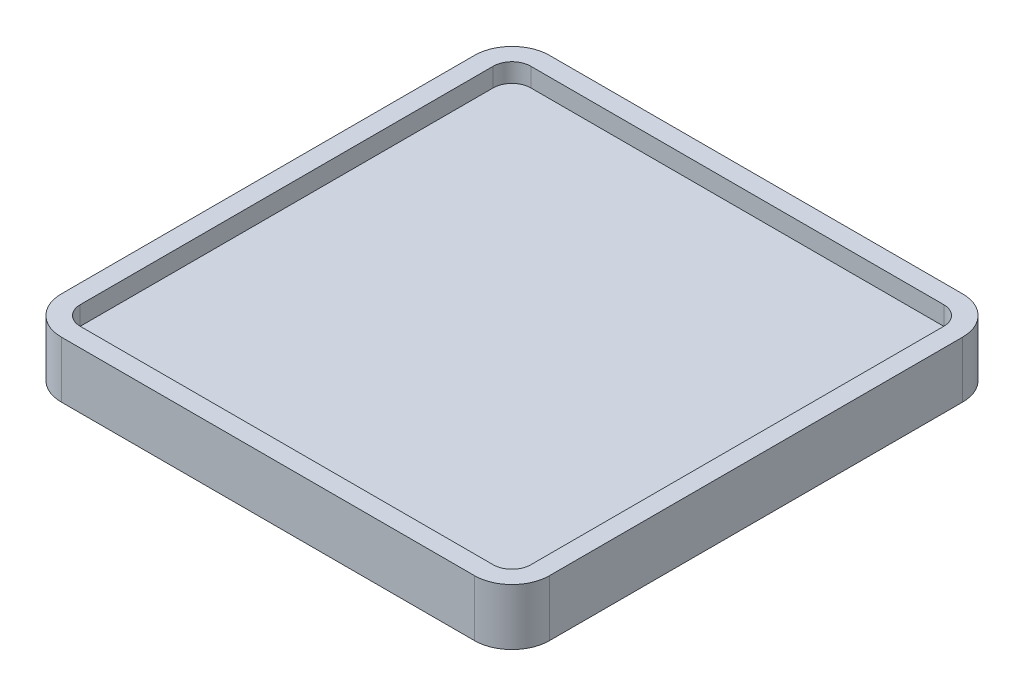
ISO-10303-21;
HEADER;
FILE_DESCRIPTION(('STEP AP214'),'2;1');
FILE_NAME('part.step','',(''),(''),'','','');
FILE_SCHEMA(('AUTOMOTIVE_DESIGN { 1 0 10303 214 1 1 1 1 }'));
ENDSEC;
DATA;
#1=APPLICATION_CONTEXT('core data for automotive mechanical design processes');
#2=APPLICATION_PROTOCOL_DEFINITION('international standard','automotive_design',2000,#1);
#3=PRODUCT_CONTEXT('',#1,'mechanical');
#4=PRODUCT('Part','Part','',(#3));
#5=PRODUCT_RELATED_PRODUCT_CATEGORY('part','',(#4));
#6=PRODUCT_DEFINITION_FORMATION('','',#4);
#7=PRODUCT_DEFINITION_CONTEXT('part definition',#1,'design');
#8=PRODUCT_DEFINITION('design','',#6,#7);
#9=PRODUCT_DEFINITION_SHAPE('','',#8);
#10=(LENGTH_UNIT() NAMED_UNIT(*) SI_UNIT(.MILLI.,.METRE.));
#11=(NAMED_UNIT(*) PLANE_ANGLE_UNIT() SI_UNIT($,.RADIAN.));
#12=(NAMED_UNIT(*) SI_UNIT($,.STERADIAN.) SOLID_ANGLE_UNIT());
#13=UNCERTAINTY_MEASURE_WITH_UNIT(LENGTH_MEASURE(1.E-05),#10,'distance_accuracy_value','');
#14=(GEOMETRIC_REPRESENTATION_CONTEXT(3) GLOBAL_UNCERTAINTY_ASSIGNED_CONTEXT((#13)) GLOBAL_UNIT_ASSIGNED_CONTEXT((#10,
#11,#12)) REPRESENTATION_CONTEXT('',''));
#15=CARTESIAN_POINT('',(0.,0.,0.));
#16=DIRECTION('',(0.,0.,1.));
#17=DIRECTION('',(1.,0.,0.));
#18=AXIS2_PLACEMENT_3D('',#15,#16,#17);
#19=CARTESIAN_POINT('',(-11.,1.,-11.));
#20=DIRECTION('',(0.,1.,0.));
#21=DIRECTION('',(0.,0.,1.));
#22=AXIS2_PLACEMENT_3D('',#19,#20,#21);
#23=PLANE('',#22);
#24=CARTESIAN_POINT('',(-11.,1.,-11.));
#25=DIRECTION('',(0.,1.,0.));
#26=DIRECTION('',(0.,0.,1.));
#27=AXIS2_PLACEMENT_3D('',#24,#25,#26);
#28=CIRCLE('',#27,2.);
#29=CARTESIAN_POINT('',(-11.,1.,-13.));
#30=VERTEX_POINT('',#29);
#31=CARTESIAN_POINT('',(-13.,1.,-11.));
#32=VERTEX_POINT('',#31);
#33=EDGE_CURVE('E156',#30,#32,#28,.T.);
#34=ORIENTED_EDGE('',*,*,#33,.T.);
#35=DIRECTION('',(0.,0.,1.));
#36=VECTOR('',#35,1.);
#37=CARTESIAN_POINT('',(-13.,1.,-11.));
#38=LINE('',#37,#36);
#39=CARTESIAN_POINT('',(-13.,1.,11.));
#40=VERTEX_POINT('',#39);
#41=EDGE_CURVE('E246',#32,#40,#38,.T.);
#42=ORIENTED_EDGE('',*,*,#41,.T.);
#43=CARTESIAN_POINT('',(-11.,1.,11.));
#44=DIRECTION('',(0.,1.,0.));
#45=DIRECTION('',(0.,0.,1.));
#46=AXIS2_PLACEMENT_3D('',#43,#44,#45);
#47=CIRCLE('',#46,2.);
#48=CARTESIAN_POINT('',(-11.,1.,13.));
#49=VERTEX_POINT('',#48);
#50=EDGE_CURVE('E248',#40,#49,#47,.T.);
#51=ORIENTED_EDGE('',*,*,#50,.T.);
#52=DIRECTION('',(1.,0.,0.));
#53=VECTOR('',#52,1.);
#54=CARTESIAN_POINT('',(-11.,1.,13.));
#55=LINE('',#54,#53);
#56=CARTESIAN_POINT('',(11.,1.,13.));
#57=VERTEX_POINT('',#56);
#58=EDGE_CURVE('E250',#49,#57,#55,.T.);
#59=ORIENTED_EDGE('',*,*,#58,.T.);
#60=CARTESIAN_POINT('',(11.,1.,11.));
#61=DIRECTION('',(0.,1.,0.));
#62=DIRECTION('',(0.,0.,1.));
#63=AXIS2_PLACEMENT_3D('',#60,#61,#62);
#64=CIRCLE('',#63,2.);
#65=CARTESIAN_POINT('',(13.,1.,11.));
#66=VERTEX_POINT('',#65);
#67=EDGE_CURVE('E252',#57,#66,#64,.T.);
#68=ORIENTED_EDGE('',*,*,#67,.T.);
#69=DIRECTION('',(0.,0.,-1.));
#70=VECTOR('',#69,1.);
#71=CARTESIAN_POINT('',(13.,1.,-11.));
#72=LINE('',#71,#70);
#73=CARTESIAN_POINT('',(13.,1.,-11.));
#74=VERTEX_POINT('',#73);
#75=EDGE_CURVE('E254',#66,#74,#72,.T.);
#76=ORIENTED_EDGE('',*,*,#75,.T.);
#77=CARTESIAN_POINT('',(11.,1.,-11.));
#78=DIRECTION('',(0.,1.,0.));
#79=DIRECTION('',(0.,0.,1.));
#80=AXIS2_PLACEMENT_3D('',#77,#78,#79);
#81=CIRCLE('',#80,2.);
#82=CARTESIAN_POINT('',(11.,1.,-13.));
#83=VERTEX_POINT('',#82);
#84=EDGE_CURVE('E256',#74,#83,#81,.T.);
#85=ORIENTED_EDGE('',*,*,#84,.T.);
#86=DIRECTION('',(-1.,0.,0.));
#87=VECTOR('',#86,1.);
#88=CARTESIAN_POINT('',(-11.,1.,-13.));
#89=LINE('',#88,#87);
#90=EDGE_CURVE('E61',#83,#30,#89,.T.);
#91=ORIENTED_EDGE('',*,*,#90,.T.);
#92=EDGE_LOOP('',(#34,#42,#51,#59,#68,#76,#85,#91));
#93=FACE_BOUND('',#92,.T.);
#94=DIRECTION('',(1.,0.,0.));
#95=VECTOR('',#94,1.);
#96=CARTESIAN_POINT('',(-11.,1.,12.));
#97=LINE('',#96,#95);
#98=CARTESIAN_POINT('',(-11.,1.,12.));
#99=VERTEX_POINT('',#98);
#100=CARTESIAN_POINT('',(11.,1.,12.));
#101=VERTEX_POINT('',#100);
#102=EDGE_CURVE('E192',#99,#101,#97,.T.);
#103=ORIENTED_EDGE('',*,*,#102,.F.);
#104=CARTESIAN_POINT('',(-11.,1.,11.));
#105=DIRECTION('',(0.,1.,0.));
#106=DIRECTION('',(0.,0.,1.));
#107=AXIS2_PLACEMENT_3D('',#104,#105,#106);
#108=CIRCLE('',#107,1.);
#109=CARTESIAN_POINT('',(-12.,1.,11.));
#110=VERTEX_POINT('',#109);
#111=EDGE_CURVE('E190',#110,#99,#108,.T.);
#112=ORIENTED_EDGE('',*,*,#111,.F.);
#113=DIRECTION('',(0.,0.,1.));
#114=VECTOR('',#113,1.);
#115=CARTESIAN_POINT('',(-12.,1.,-11.));
#116=LINE('',#115,#114);
#117=CARTESIAN_POINT('',(-12.,1.,-11.));
#118=VERTEX_POINT('',#117);
#119=EDGE_CURVE('E205',#118,#110,#116,.T.);
#120=ORIENTED_EDGE('',*,*,#119,.F.);
#121=CARTESIAN_POINT('',(-11.,1.,-11.));
#122=DIRECTION('',(0.,1.,0.));
#123=DIRECTION('',(0.,0.,1.));
#124=AXIS2_PLACEMENT_3D('',#121,#122,#123);
#125=CIRCLE('',#124,1.);
#126=CARTESIAN_POINT('',(-11.,1.,-12.));
#127=VERTEX_POINT('',#126);
#128=EDGE_CURVE('E203',#127,#118,#125,.T.);
#129=ORIENTED_EDGE('',*,*,#128,.F.);
#130=DIRECTION('',(-1.,0.,0.));
#131=VECTOR('',#130,1.);
#132=CARTESIAN_POINT('',(-11.,1.,-12.));
#133=LINE('',#132,#131);
#134=CARTESIAN_POINT('',(11.,1.,-12.));
#135=VERTEX_POINT('',#134);
#136=EDGE_CURVE('E201',#135,#127,#133,.T.);
#137=ORIENTED_EDGE('',*,*,#136,.F.);
#138=CARTESIAN_POINT('',(11.,1.,-11.));
#139=DIRECTION('',(0.,1.,0.));
#140=DIRECTION('',(0.,0.,1.));
#141=AXIS2_PLACEMENT_3D('',#138,#139,#140);
#142=CIRCLE('',#141,1.);
#143=CARTESIAN_POINT('',(12.,1.,-11.));
#144=VERTEX_POINT('',#143);
#145=EDGE_CURVE('E199',#144,#135,#142,.T.);
#146=ORIENTED_EDGE('',*,*,#145,.F.);
#147=DIRECTION('',(0.,0.,-1.));
#148=VECTOR('',#147,1.);
#149=CARTESIAN_POINT('',(12.,1.,-11.));
#150=LINE('',#149,#148);
#151=CARTESIAN_POINT('',(12.,1.,11.));
#152=VERTEX_POINT('',#151);
#153=EDGE_CURVE('E197',#152,#144,#150,.T.);
#154=ORIENTED_EDGE('',*,*,#153,.F.);
#155=CARTESIAN_POINT('',(11.,1.,11.));
#156=DIRECTION('',(0.,1.,0.));
#157=DIRECTION('',(0.,0.,1.));
#158=AXIS2_PLACEMENT_3D('',#155,#156,#157);
#159=CIRCLE('',#158,1.);
#160=EDGE_CURVE('E195',#101,#152,#159,.T.);
#161=ORIENTED_EDGE('',*,*,#160,.F.);
#162=EDGE_LOOP('',(#103,#112,#120,#129,#137,#146,#154,#161));
#163=FACE_BOUND('',#162,.T.);
#164=ADVANCED_FACE('F38',(#93,#163),#23,.T.);
#165=CARTESIAN_POINT('',(-11.,1.,-11.));
#166=DIRECTION('',(0.,-1.,0.));
#167=DIRECTION('',(0.,0.,-1.));
#168=AXIS2_PLACEMENT_3D('',#165,#166,#167);
#169=CYLINDRICAL_SURFACE('',#168,2.);
#170=DIRECTION('',(0.,-1.,0.));
#171=VECTOR('',#170,1.);
#172=CARTESIAN_POINT('',(-11.,1.,-13.));
#173=LINE('',#172,#171);
#174=CARTESIAN_POINT('',(-11.,-2.,-13.));
#175=VERTEX_POINT('',#174);
#176=EDGE_CURVE('E151',#30,#175,#173,.T.);
#177=ORIENTED_EDGE('',*,*,#176,.T.);
#178=CARTESIAN_POINT('',(-11.,-2.,-11.));
#179=DIRECTION('',(0.,-1.,0.));
#180=DIRECTION('',(0.,0.,-1.));
#181=AXIS2_PLACEMENT_3D('',#178,#179,#180);
#182=CIRCLE('',#181,2.);
#183=CARTESIAN_POINT('',(-13.,-2.,-11.));
#184=VERTEX_POINT('',#183);
#185=EDGE_CURVE('E155',#184,#175,#182,.T.);
#186=ORIENTED_EDGE('',*,*,#185,.F.);
#187=DIRECTION('',(0.,-1.,0.));
#188=VECTOR('',#187,1.);
#189=CARTESIAN_POINT('',(-13.,1.,-11.));
#190=LINE('',#189,#188);
#191=EDGE_CURVE('E11',#32,#184,#190,.T.);
#192=ORIENTED_EDGE('',*,*,#191,.F.);
#193=ORIENTED_EDGE('',*,*,#33,.F.);
#194=EDGE_LOOP('',(#177,#186,#192,#193));
#195=FACE_BOUND('',#194,.T.);
#196=ADVANCED_FACE('F40',(#195),#169,.T.);
#197=CARTESIAN_POINT('',(-13.,1.,-11.));
#198=DIRECTION('',(1.,0.,0.));
#199=DIRECTION('',(0.,0.,-1.));
#200=AXIS2_PLACEMENT_3D('',#197,#198,#199);
#201=PLANE('',#200);
#202=ORIENTED_EDGE('',*,*,#191,.T.);
#203=DIRECTION('',(0.,0.,-1.));
#204=VECTOR('',#203,1.);
#205=CARTESIAN_POINT('',(-13.,-2.,11.));
#206=LINE('',#205,#204);
#207=CARTESIAN_POINT('',(-13.,-2.,11.));
#208=VERTEX_POINT('',#207);
#209=EDGE_CURVE('E173',#208,#184,#206,.T.);
#210=ORIENTED_EDGE('',*,*,#209,.F.);
#211=DIRECTION('',(0.,-1.,0.));
#212=VECTOR('',#211,1.);
#213=CARTESIAN_POINT('',(-13.,1.,11.));
#214=LINE('',#213,#212);
#215=EDGE_CURVE('E46',#40,#208,#214,.T.);
#216=ORIENTED_EDGE('',*,*,#215,.F.);
#217=ORIENTED_EDGE('',*,*,#41,.F.);
#218=EDGE_LOOP('',(#202,#210,#216,#217));
#219=FACE_BOUND('',#218,.T.);
#220=ADVANCED_FACE('F275',(#219),#201,.F.);
#221=CARTESIAN_POINT('',(-11.,1.,11.));
#222=DIRECTION('',(0.,-1.,0.));
#223=DIRECTION('',(0.,0.,-1.));
#224=AXIS2_PLACEMENT_3D('',#221,#222,#223);
#225=CYLINDRICAL_SURFACE('',#224,2.);
#226=ORIENTED_EDGE('',*,*,#215,.T.);
#227=CARTESIAN_POINT('',(-11.,-2.,11.));
#228=DIRECTION('',(0.,-1.,0.));
#229=DIRECTION('',(0.,0.,-1.));
#230=AXIS2_PLACEMENT_3D('',#227,#228,#229);
#231=CIRCLE('',#230,2.);
#232=CARTESIAN_POINT('',(-11.,-2.,13.));
#233=VERTEX_POINT('',#232);
#234=EDGE_CURVE('E186',#233,#208,#231,.T.);
#235=ORIENTED_EDGE('',*,*,#234,.F.);
#236=DIRECTION('',(0.,-1.,0.));
#237=VECTOR('',#236,1.);
#238=CARTESIAN_POINT('',(-11.,1.,13.));
#239=LINE('',#238,#237);
#240=EDGE_CURVE('E266',#49,#233,#239,.T.);
#241=ORIENTED_EDGE('',*,*,#240,.F.);
#242=ORIENTED_EDGE('',*,*,#50,.F.);
#243=EDGE_LOOP('',(#226,#235,#241,#242));
#244=FACE_BOUND('',#243,.T.);
#245=ADVANCED_FACE('F271',(#244),#225,.T.);
#246=CARTESIAN_POINT('',(-11.,1.,13.));
#247=DIRECTION('',(0.,0.,-1.));
#248=DIRECTION('',(-1.,0.,0.));
#249=AXIS2_PLACEMENT_3D('',#246,#247,#248);
#250=PLANE('',#249);
#251=ORIENTED_EDGE('',*,*,#240,.T.);
#252=DIRECTION('',(-1.,0.,0.));
#253=VECTOR('',#252,1.);
#254=CARTESIAN_POINT('',(11.,-2.,13.));
#255=LINE('',#254,#253);
#256=CARTESIAN_POINT('',(11.,-2.,13.));
#257=VERTEX_POINT('',#256);
#258=EDGE_CURVE('E183',#257,#233,#255,.T.);
#259=ORIENTED_EDGE('',*,*,#258,.F.);
#260=DIRECTION('',(0.,-1.,0.));
#261=VECTOR('',#260,1.);
#262=CARTESIAN_POINT('',(11.,1.,13.));
#263=LINE('',#262,#261);
#264=EDGE_CURVE('E264',#57,#257,#263,.T.);
#265=ORIENTED_EDGE('',*,*,#264,.F.);
#266=ORIENTED_EDGE('',*,*,#58,.F.);
#267=EDGE_LOOP('',(#251,#259,#265,#266));
#268=FACE_BOUND('',#267,.T.);
#269=ADVANCED_FACE('F344',(#268),#250,.F.);
#270=CARTESIAN_POINT('',(11.,1.,11.));
#271=DIRECTION('',(0.,-1.,0.));
#272=DIRECTION('',(0.,0.,-1.));
#273=AXIS2_PLACEMENT_3D('',#270,#271,#272);
#274=CYLINDRICAL_SURFACE('',#273,2.);
#275=ORIENTED_EDGE('',*,*,#264,.T.);
#276=CARTESIAN_POINT('',(11.,-2.,11.));
#277=DIRECTION('',(0.,-1.,0.));
#278=DIRECTION('',(0.,0.,-1.));
#279=AXIS2_PLACEMENT_3D('',#276,#277,#278);
#280=CIRCLE('',#279,2.);
#281=CARTESIAN_POINT('',(13.,-2.,11.));
#282=VERTEX_POINT('',#281);
#283=EDGE_CURVE('E180',#282,#257,#280,.T.);
#284=ORIENTED_EDGE('',*,*,#283,.F.);
#285=DIRECTION('',(0.,-1.,0.));
#286=VECTOR('',#285,1.);
#287=CARTESIAN_POINT('',(13.,1.,11.));
#288=LINE('',#287,#286);
#289=EDGE_CURVE('E262',#66,#282,#288,.T.);
#290=ORIENTED_EDGE('',*,*,#289,.F.);
#291=ORIENTED_EDGE('',*,*,#67,.F.);
#292=EDGE_LOOP('',(#275,#284,#290,#291));
#293=FACE_BOUND('',#292,.T.);
#294=ADVANCED_FACE('F340',(#293),#274,.T.);
#295=CARTESIAN_POINT('',(13.,1.,-11.));
#296=DIRECTION('',(-1.,0.,0.));
#297=DIRECTION('',(0.,0.,1.));
#298=AXIS2_PLACEMENT_3D('',#295,#296,#297);
#299=PLANE('',#298);
#300=ORIENTED_EDGE('',*,*,#289,.T.);
#301=DIRECTION('',(0.,0.,1.));
#302=VECTOR('',#301,1.);
#303=CARTESIAN_POINT('',(13.,-2.,-11.));
#304=LINE('',#303,#302);
#305=CARTESIAN_POINT('',(13.,-2.,-11.));
#306=VERTEX_POINT('',#305);
#307=EDGE_CURVE('E177',#306,#282,#304,.T.);
#308=ORIENTED_EDGE('',*,*,#307,.F.);
#309=DIRECTION('',(0.,-1.,0.));
#310=VECTOR('',#309,1.);
#311=CARTESIAN_POINT('',(13.,1.,-11.));
#312=LINE('',#311,#310);
#313=EDGE_CURVE('E260',#74,#306,#312,.T.);
#314=ORIENTED_EDGE('',*,*,#313,.F.);
#315=ORIENTED_EDGE('',*,*,#75,.F.);
#316=EDGE_LOOP('',(#300,#308,#314,#315));
#317=FACE_BOUND('',#316,.T.);
#318=ADVANCED_FACE('F336',(#317),#299,.F.);
#319=CARTESIAN_POINT('',(11.,1.,-11.));
#320=DIRECTION('',(0.,-1.,0.));
#321=DIRECTION('',(0.,0.,-1.));
#322=AXIS2_PLACEMENT_3D('',#319,#320,#321);
#323=CYLINDRICAL_SURFACE('',#322,2.);
#324=ORIENTED_EDGE('',*,*,#313,.T.);
#325=CARTESIAN_POINT('',(11.,-2.,-11.));
#326=DIRECTION('',(0.,-1.,0.));
#327=DIRECTION('',(0.,0.,-1.));
#328=AXIS2_PLACEMENT_3D('',#325,#326,#327);
#329=CIRCLE('',#328,2.);
#330=CARTESIAN_POINT('',(11.,-2.,-13.));
#331=VERTEX_POINT('',#330);
#332=EDGE_CURVE('E167',#331,#306,#329,.T.);
#333=ORIENTED_EDGE('',*,*,#332,.F.);
#334=DIRECTION('',(0.,-1.,0.));
#335=VECTOR('',#334,1.);
#336=CARTESIAN_POINT('',(11.,1.,-13.));
#337=LINE('',#336,#335);
#338=EDGE_CURVE('E158',#83,#331,#337,.T.);
#339=ORIENTED_EDGE('',*,*,#338,.F.);
#340=ORIENTED_EDGE('',*,*,#84,.F.);
#341=EDGE_LOOP('',(#324,#333,#339,#340));
#342=FACE_BOUND('',#341,.T.);
#343=ADVANCED_FACE('F333',(#342),#323,.T.);
#344=CARTESIAN_POINT('',(-11.,1.,-13.));
#345=DIRECTION('',(0.,0.,1.));
#346=DIRECTION('',(1.,0.,0.));
#347=AXIS2_PLACEMENT_3D('',#344,#345,#346);
#348=PLANE('',#347);
#349=ORIENTED_EDGE('',*,*,#338,.T.);
#350=DIRECTION('',(1.,0.,0.));
#351=VECTOR('',#350,1.);
#352=CARTESIAN_POINT('',(-11.,-2.,-13.));
#353=LINE('',#352,#351);
#354=EDGE_CURVE('E161',#175,#331,#353,.T.);
#355=ORIENTED_EDGE('',*,*,#354,.F.);
#356=ORIENTED_EDGE('',*,*,#176,.F.);
#357=ORIENTED_EDGE('',*,*,#90,.F.);
#358=EDGE_LOOP('',(#349,#355,#356,#357));
#359=FACE_BOUND('',#358,.T.);
#360=ADVANCED_FACE('F162',(#359),#348,.F.);
#361=CARTESIAN_POINT('',(-11.,1.,11.));
#362=DIRECTION('',(0.,-1.,0.));
#363=DIRECTION('',(0.,0.,-1.));
#364=AXIS2_PLACEMENT_3D('',#361,#362,#363);
#365=CYLINDRICAL_SURFACE('',#364,1.);
#366=CARTESIAN_POINT('',(-11.,0.,11.));
#367=DIRECTION('',(0.,1.,0.));
#368=DIRECTION('',(0.,0.,1.));
#369=AXIS2_PLACEMENT_3D('',#366,#367,#368);
#370=CIRCLE('',#369,1.);
#371=CARTESIAN_POINT('',(-12.,0.,11.));
#372=VERTEX_POINT('',#371);
#373=CARTESIAN_POINT('',(-11.,0.,12.));
#374=VERTEX_POINT('',#373);
#375=EDGE_CURVE('E189',#372,#374,#370,.T.);
#376=ORIENTED_EDGE('',*,*,#375,.F.);
#377=DIRECTION('',(0.,-1.,0.));
#378=VECTOR('',#377,1.);
#379=CARTESIAN_POINT('',(-12.,1.,11.));
#380=LINE('',#379,#378);
#381=EDGE_CURVE('E207',#110,#372,#380,.T.);
#382=ORIENTED_EDGE('',*,*,#381,.F.);
#383=ORIENTED_EDGE('',*,*,#111,.T.);
#384=DIRECTION('',(0.,-1.,0.));
#385=VECTOR('',#384,1.);
#386=CARTESIAN_POINT('',(-11.,1.,12.));
#387=LINE('',#386,#385);
#388=EDGE_CURVE('E242',#99,#374,#387,.T.);
#389=ORIENTED_EDGE('',*,*,#388,.T.);
#390=EDGE_LOOP('',(#376,#382,#383,#389));
#391=FACE_BOUND('',#390,.T.);
#392=ADVANCED_FACE('F297',(#391),#365,.F.);
#393=CARTESIAN_POINT('',(-11.,1.,12.));
#394=DIRECTION('',(0.,0.,-1.));
#395=DIRECTION('',(-1.,0.,0.));
#396=AXIS2_PLACEMENT_3D('',#393,#394,#395);
#397=PLANE('',#396);
#398=DIRECTION('',(1.,0.,0.));
#399=VECTOR('',#398,1.);
#400=CARTESIAN_POINT('',(-11.,0.,12.));
#401=LINE('',#400,#399);
#402=CARTESIAN_POINT('',(11.,0.,12.));
#403=VERTEX_POINT('',#402);
#404=EDGE_CURVE('E210',#374,#403,#401,.T.);
#405=ORIENTED_EDGE('',*,*,#404,.F.);
#406=ORIENTED_EDGE('',*,*,#388,.F.);
#407=ORIENTED_EDGE('',*,*,#102,.T.);
#408=DIRECTION('',(0.,-1.,0.));
#409=VECTOR('',#408,1.);
#410=CARTESIAN_POINT('',(11.,1.,12.));
#411=LINE('',#410,#409);
#412=EDGE_CURVE('E240',#101,#403,#411,.T.);
#413=ORIENTED_EDGE('',*,*,#412,.T.);
#414=EDGE_LOOP('',(#405,#406,#407,#413));
#415=FACE_BOUND('',#414,.T.);
#416=ADVANCED_FACE('F287',(#415),#397,.T.);
#417=CARTESIAN_POINT('',(11.,1.,11.));
#418=DIRECTION('',(0.,-1.,0.));
#419=DIRECTION('',(0.,0.,-1.));
#420=AXIS2_PLACEMENT_3D('',#417,#418,#419);
#421=CYLINDRICAL_SURFACE('',#420,1.);
#422=CARTESIAN_POINT('',(11.,0.,11.));
#423=DIRECTION('',(0.,1.,0.));
#424=DIRECTION('',(0.,0.,1.));
#425=AXIS2_PLACEMENT_3D('',#422,#423,#424);
#426=CIRCLE('',#425,1.);
#427=CARTESIAN_POINT('',(12.,0.,11.));
#428=VERTEX_POINT('',#427);
#429=EDGE_CURVE('E213',#403,#428,#426,.T.);
#430=ORIENTED_EDGE('',*,*,#429,.F.);
#431=ORIENTED_EDGE('',*,*,#412,.F.);
#432=ORIENTED_EDGE('',*,*,#160,.T.);
#433=DIRECTION('',(0.,-1.,0.));
#434=VECTOR('',#433,1.);
#435=CARTESIAN_POINT('',(12.,1.,11.));
#436=LINE('',#435,#434);
#437=EDGE_CURVE('E238',#152,#428,#436,.T.);
#438=ORIENTED_EDGE('',*,*,#437,.T.);
#439=EDGE_LOOP('',(#430,#431,#432,#438));
#440=FACE_BOUND('',#439,.T.);
#441=ADVANCED_FACE('F290',(#440),#421,.F.);
#442=CARTESIAN_POINT('',(12.,1.,-11.));
#443=DIRECTION('',(-1.,0.,0.));
#444=DIRECTION('',(0.,0.,1.));
#445=AXIS2_PLACEMENT_3D('',#442,#443,#444);
#446=PLANE('',#445);
#447=DIRECTION('',(0.,0.,-1.));
#448=VECTOR('',#447,1.);
#449=CARTESIAN_POINT('',(12.,0.,-11.));
#450=LINE('',#449,#448);
#451=CARTESIAN_POINT('',(12.,0.,-11.));
#452=VERTEX_POINT('',#451);
#453=EDGE_CURVE('E216',#428,#452,#450,.T.);
#454=ORIENTED_EDGE('',*,*,#453,.F.);
#455=ORIENTED_EDGE('',*,*,#437,.F.);
#456=ORIENTED_EDGE('',*,*,#153,.T.);
#457=DIRECTION('',(0.,-1.,0.));
#458=VECTOR('',#457,1.);
#459=CARTESIAN_POINT('',(12.,1.,-11.));
#460=LINE('',#459,#458);
#461=EDGE_CURVE('E236',#144,#452,#460,.T.);
#462=ORIENTED_EDGE('',*,*,#461,.T.);
#463=EDGE_LOOP('',(#454,#455,#456,#462));
#464=FACE_BOUND('',#463,.T.);
#465=ADVANCED_FACE('F316',(#464),#446,.T.);
#466=CARTESIAN_POINT('',(11.,1.,-11.));
#467=DIRECTION('',(0.,-1.,0.));
#468=DIRECTION('',(0.,0.,-1.));
#469=AXIS2_PLACEMENT_3D('',#466,#467,#468);
#470=CYLINDRICAL_SURFACE('',#469,1.);
#471=CARTESIAN_POINT('',(11.,0.,-11.));
#472=DIRECTION('',(0.,1.,0.));
#473=DIRECTION('',(0.,0.,1.));
#474=AXIS2_PLACEMENT_3D('',#471,#472,#473);
#475=CIRCLE('',#474,1.);
#476=CARTESIAN_POINT('',(11.,0.,-12.));
#477=VERTEX_POINT('',#476);
#478=EDGE_CURVE('E219',#452,#477,#475,.T.);
#479=ORIENTED_EDGE('',*,*,#478,.F.);
#480=ORIENTED_EDGE('',*,*,#461,.F.);
#481=ORIENTED_EDGE('',*,*,#145,.T.);
#482=DIRECTION('',(0.,-1.,0.));
#483=VECTOR('',#482,1.);
#484=CARTESIAN_POINT('',(11.,1.,-12.));
#485=LINE('',#484,#483);
#486=EDGE_CURVE('E234',#135,#477,#485,.T.);
#487=ORIENTED_EDGE('',*,*,#486,.T.);
#488=EDGE_LOOP('',(#479,#480,#481,#487));
#489=FACE_BOUND('',#488,.T.);
#490=ADVANCED_FACE('F313',(#489),#470,.F.);
#491=CARTESIAN_POINT('',(-11.,1.,-12.));
#492=DIRECTION('',(0.,0.,1.));
#493=DIRECTION('',(1.,0.,0.));
#494=AXIS2_PLACEMENT_3D('',#491,#492,#493);
#495=PLANE('',#494);
#496=DIRECTION('',(-1.,0.,0.));
#497=VECTOR('',#496,1.);
#498=CARTESIAN_POINT('',(-11.,0.,-12.));
#499=LINE('',#498,#497);
#500=CARTESIAN_POINT('',(-11.,0.,-12.));
#501=VERTEX_POINT('',#500);
#502=EDGE_CURVE('E222',#477,#501,#499,.T.);
#503=ORIENTED_EDGE('',*,*,#502,.F.);
#504=ORIENTED_EDGE('',*,*,#486,.F.);
#505=ORIENTED_EDGE('',*,*,#136,.T.);
#506=DIRECTION('',(0.,-1.,0.));
#507=VECTOR('',#506,1.);
#508=CARTESIAN_POINT('',(-11.,1.,-12.));
#509=LINE('',#508,#507);
#510=EDGE_CURVE('E232',#127,#501,#509,.T.);
#511=ORIENTED_EDGE('',*,*,#510,.T.);
#512=EDGE_LOOP('',(#503,#504,#505,#511));
#513=FACE_BOUND('',#512,.T.);
#514=ADVANCED_FACE('F309',(#513),#495,.T.);
#515=CARTESIAN_POINT('',(-11.,1.,-11.));
#516=DIRECTION('',(0.,-1.,0.));
#517=DIRECTION('',(0.,0.,-1.));
#518=AXIS2_PLACEMENT_3D('',#515,#516,#517);
#519=CYLINDRICAL_SURFACE('',#518,1.);
#520=CARTESIAN_POINT('',(-11.,0.,-11.));
#521=DIRECTION('',(0.,1.,0.));
#522=DIRECTION('',(0.,0.,1.));
#523=AXIS2_PLACEMENT_3D('',#520,#521,#522);
#524=CIRCLE('',#523,1.);
#525=CARTESIAN_POINT('',(-12.,0.,-11.));
#526=VERTEX_POINT('',#525);
#527=EDGE_CURVE('E225',#501,#526,#524,.T.);
#528=ORIENTED_EDGE('',*,*,#527,.F.);
#529=ORIENTED_EDGE('',*,*,#510,.F.);
#530=ORIENTED_EDGE('',*,*,#128,.T.);
#531=DIRECTION('',(0.,-1.,0.));
#532=VECTOR('',#531,1.);
#533=CARTESIAN_POINT('',(-12.,1.,-11.));
#534=LINE('',#533,#532);
#535=EDGE_CURVE('E53',#118,#526,#534,.T.);
#536=ORIENTED_EDGE('',*,*,#535,.T.);
#537=EDGE_LOOP('',(#528,#529,#530,#536));
#538=FACE_BOUND('',#537,.T.);
#539=ADVANCED_FACE('F306',(#538),#519,.F.);
#540=CARTESIAN_POINT('',(-12.,1.,-11.));
#541=DIRECTION('',(1.,0.,0.));
#542=DIRECTION('',(0.,0.,-1.));
#543=AXIS2_PLACEMENT_3D('',#540,#541,#542);
#544=PLANE('',#543);
#545=DIRECTION('',(0.,0.,1.));
#546=VECTOR('',#545,1.);
#547=CARTESIAN_POINT('',(-12.,0.,-11.));
#548=LINE('',#547,#546);
#549=EDGE_CURVE('E193',#526,#372,#548,.T.);
#550=ORIENTED_EDGE('',*,*,#549,.F.);
#551=ORIENTED_EDGE('',*,*,#535,.F.);
#552=ORIENTED_EDGE('',*,*,#119,.T.);
#553=ORIENTED_EDGE('',*,*,#381,.T.);
#554=EDGE_LOOP('',(#550,#551,#552,#553));
#555=FACE_BOUND('',#554,.T.);
#556=ADVANCED_FACE('F299',(#555),#544,.T.);
#557=CARTESIAN_POINT('',(-11.,0.,-11.));
#558=DIRECTION('',(0.,-1.,0.));
#559=DIRECTION('',(0.,0.,-1.));
#560=AXIS2_PLACEMENT_3D('',#557,#558,#559);
#561=PLANE('',#560);
#562=ORIENTED_EDGE('',*,*,#549,.T.);
#563=ORIENTED_EDGE('',*,*,#375,.T.);
#564=ORIENTED_EDGE('',*,*,#404,.T.);
#565=ORIENTED_EDGE('',*,*,#429,.T.);
#566=ORIENTED_EDGE('',*,*,#453,.T.);
#567=ORIENTED_EDGE('',*,*,#478,.T.);
#568=ORIENTED_EDGE('',*,*,#502,.T.);
#569=ORIENTED_EDGE('',*,*,#527,.T.);
#570=EDGE_LOOP('',(#562,#563,#564,#565,#566,#567,#568,#569));
#571=FACE_BOUND('',#570,.T.);
#572=ADVANCED_FACE('F294',(#571),#561,.F.);
#573=CARTESIAN_POINT('',(-11.,-2.,-11.));
#574=DIRECTION('',(0.,-1.,0.));
#575=DIRECTION('',(0.,0.,-1.));
#576=AXIS2_PLACEMENT_3D('',#573,#574,#575);
#577=PLANE('',#576);
#578=ORIENTED_EDGE('',*,*,#185,.T.);
#579=ORIENTED_EDGE('',*,*,#354,.T.);
#580=ORIENTED_EDGE('',*,*,#332,.T.);
#581=ORIENTED_EDGE('',*,*,#307,.T.);
#582=ORIENTED_EDGE('',*,*,#283,.T.);
#583=ORIENTED_EDGE('',*,*,#258,.T.);
#584=ORIENTED_EDGE('',*,*,#234,.T.);
#585=ORIENTED_EDGE('',*,*,#209,.T.);
#586=EDGE_LOOP('',(#578,#579,#580,#581,#582,#583,#584,#585));
#587=FACE_BOUND('',#586,.T.);
#588=ADVANCED_FACE('F170',(#587),#577,.T.);
#589=CLOSED_SHELL('',(#164,#196,#220,#245,#269,#294,#318,#343,#360,#392,#416,#441,#465,#490,
#514,#539,#556,#572,#588));
#590=MANIFOLD_SOLID_BREP('B2',#589);
#591=ADVANCED_BREP_SHAPE_REPRESENTATION('',(#18,#590),#14);
#592=SHAPE_DEFINITION_REPRESENTATION(#9,#591);
ENDSEC;
END-ISO-10303-21;
